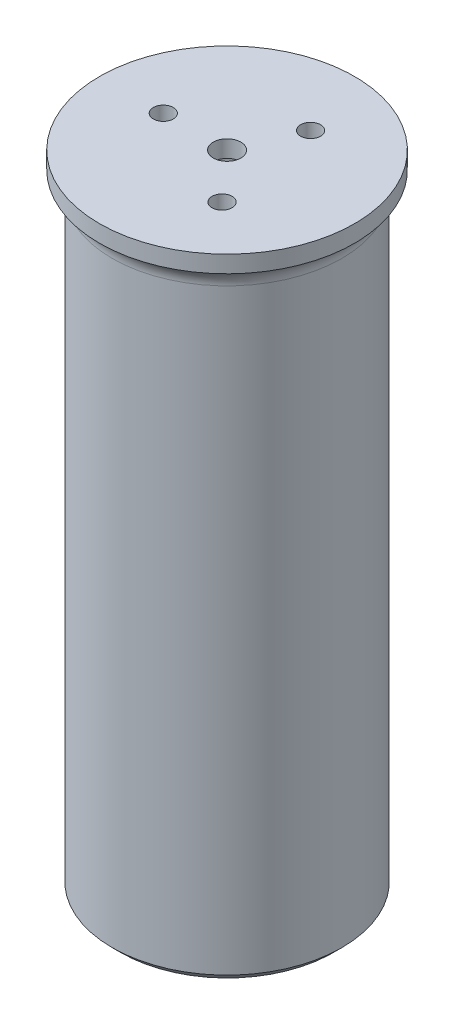
ISO-10303-21;
HEADER;
FILE_DESCRIPTION(('STEP AP214'),'2;1');
FILE_NAME('part.step','',(''),(''),'','','');
FILE_SCHEMA(('AUTOMOTIVE_DESIGN { 1 0 10303 214 1 1 1 1 }'));
ENDSEC;
DATA;
#1=APPLICATION_CONTEXT('core data for automotive mechanical design processes');
#2=APPLICATION_PROTOCOL_DEFINITION('international standard','automotive_design',2000,#1);
#3=PRODUCT_CONTEXT('',#1,'mechanical');
#4=PRODUCT('Part','Part','',(#3));
#5=PRODUCT_RELATED_PRODUCT_CATEGORY('part','',(#4));
#6=PRODUCT_DEFINITION_FORMATION('','',#4);
#7=PRODUCT_DEFINITION_CONTEXT('part definition',#1,'design');
#8=PRODUCT_DEFINITION('design','',#6,#7);
#9=PRODUCT_DEFINITION_SHAPE('','',#8);
#10=(LENGTH_UNIT() NAMED_UNIT(*) SI_UNIT(.MILLI.,.METRE.));
#11=(NAMED_UNIT(*) PLANE_ANGLE_UNIT() SI_UNIT($,.RADIAN.));
#12=(NAMED_UNIT(*) SI_UNIT($,.STERADIAN.) SOLID_ANGLE_UNIT());
#13=UNCERTAINTY_MEASURE_WITH_UNIT(LENGTH_MEASURE(1.E-05),#10,'distance_accuracy_value','');
#14=(GEOMETRIC_REPRESENTATION_CONTEXT(3) GLOBAL_UNCERTAINTY_ASSIGNED_CONTEXT((#13)) GLOBAL_UNIT_ASSIGNED_CONTEXT((#10,
#11,#12)) REPRESENTATION_CONTEXT('',''));
#15=CARTESIAN_POINT('',(0.,0.,0.));
#16=DIRECTION('',(0.,0.,1.));
#17=DIRECTION('',(1.,0.,0.));
#18=AXIS2_PLACEMENT_3D('',#15,#16,#17);
#19=CARTESIAN_POINT('',(0.,0.,0.));
#20=DIRECTION('',(0.,1.,0.));
#21=DIRECTION('',(0.,0.,1.));
#22=AXIS2_PLACEMENT_3D('',#19,#20,#21);
#23=PLANE('',#22);
#24=CARTESIAN_POINT('',(10.,0.,11.1803398874989));
#25=DIRECTION('',(0.,1.,0.));
#26=DIRECTION('',(0.,0.,1.));
#27=AXIS2_PLACEMENT_3D('',#24,#25,#26);
#28=CIRCLE('',#27,2.35);
#29=CARTESIAN_POINT('',(10.,0.,13.5303398874989));
#30=VERTEX_POINT('',#29);
#31=EDGE_CURVE('E67',#30,#30,#28,.T.);
#32=ORIENTED_EDGE('',*,*,#31,.T.);
#33=EDGE_LOOP('',(#32));
#34=FACE_BOUND('',#33,.T.);
#35=CARTESIAN_POINT('',(5.83240896842353,0.,-13.8196601125011));
#36=DIRECTION('',(0.,1.,0.));
#37=DIRECTION('',(0.,0.,1.));
#38=AXIS2_PLACEMENT_3D('',#35,#36,#37);
#39=CIRCLE('',#38,2.35);
#40=CARTESIAN_POINT('',(5.83240896842353,0.,-11.4696601125011));
#41=VERTEX_POINT('',#40);
#42=EDGE_CURVE('E61',#41,#41,#39,.T.);
#43=ORIENTED_EDGE('',*,*,#42,.T.);
#44=EDGE_LOOP('',(#43));
#45=FACE_BOUND('',#44,.T.);
#46=CARTESIAN_POINT('',(-15.,0.,0.00100327868052491));
#47=DIRECTION('',(0.,1.,0.));
#48=DIRECTION('',(0.,0.,1.));
#49=AXIS2_PLACEMENT_3D('',#46,#47,#48);
#50=CIRCLE('',#49,2.35);
#51=CARTESIAN_POINT('',(-15.,0.,2.35100327868052));
#52=VERTEX_POINT('',#51);
#53=EDGE_CURVE('E55',#52,#52,#50,.T.);
#54=ORIENTED_EDGE('',*,*,#53,.T.);
#55=EDGE_LOOP('',(#54));
#56=FACE_BOUND('',#55,.T.);
#57=CARTESIAN_POINT('',(0.,0.,0.));
#58=DIRECTION('',(0.,1.,0.));
#59=DIRECTION('',(0.,0.,1.));
#60=AXIS2_PLACEMENT_3D('',#57,#58,#59);
#61=CIRCLE('',#60,3.25);
#62=CARTESIAN_POINT('',(0.,0.,3.25));
#63=VERTEX_POINT('',#62);
#64=EDGE_CURVE('E70',#63,#63,#61,.T.);
#65=ORIENTED_EDGE('',*,*,#64,.T.);
#66=EDGE_LOOP('',(#65));
#67=FACE_BOUND('',#66,.T.);
#68=CARTESIAN_POINT('',(0.,0.,0.));
#69=DIRECTION('',(0.,-1.,0.));
#70=DIRECTION('',(0.,0.,-1.));
#71=AXIS2_PLACEMENT_3D('',#68,#69,#70);
#72=CIRCLE('',#71,25.);
#73=CARTESIAN_POINT('',(0.,0.,-25.));
#74=VERTEX_POINT('',#73);
#75=EDGE_CURVE('E76',#74,#74,#72,.T.);
#76=ORIENTED_EDGE('',*,*,#75,.T.);
#77=EDGE_LOOP('',(#76));
#78=FACE_BOUND('',#77,.T.);
#79=ADVANCED_FACE('F31',(#34,#45,#56,#67,#78),#23,.F.);
#80=CARTESIAN_POINT('',(0.,4.,0.));
#81=DIRECTION('',(0.,1.,0.));
#82=DIRECTION('',(0.,0.,1.));
#83=AXIS2_PLACEMENT_3D('',#80,#81,#82);
#84=PLANE('',#83);
#85=CARTESIAN_POINT('',(0.,4.,0.));
#86=DIRECTION('',(0.,1.,0.));
#87=DIRECTION('',(0.,0.,1.));
#88=AXIS2_PLACEMENT_3D('',#85,#86,#87);
#89=CIRCLE('',#88,3.25);
#90=CARTESIAN_POINT('',(0.,4.,3.25));
#91=VERTEX_POINT('',#90);
#92=EDGE_CURVE('E73',#91,#91,#89,.T.);
#93=ORIENTED_EDGE('',*,*,#92,.F.);
#94=EDGE_LOOP('',(#93));
#95=FACE_BOUND('',#94,.T.);
#96=CARTESIAN_POINT('',(5.83240896842353,4.,-13.8196601125011));
#97=DIRECTION('',(0.,1.,0.));
#98=DIRECTION('',(0.,0.,1.));
#99=AXIS2_PLACEMENT_3D('',#96,#97,#98);
#100=CIRCLE('',#99,2.35);
#101=CARTESIAN_POINT('',(5.83240896842353,4.,-11.4696601125011));
#102=VERTEX_POINT('',#101);
#103=EDGE_CURVE('E58',#102,#102,#100,.T.);
#104=ORIENTED_EDGE('',*,*,#103,.F.);
#105=EDGE_LOOP('',(#104));
#106=FACE_BOUND('',#105,.T.);
#107=CARTESIAN_POINT('',(0.,4.,0.));
#108=DIRECTION('',(0.,1.,0.));
#109=DIRECTION('',(0.,0.,1.));
#110=AXIS2_PLACEMENT_3D('',#107,#108,#109);
#111=CIRCLE('',#110,30.);
#112=CARTESIAN_POINT('',(0.,4.,30.));
#113=VERTEX_POINT('',#112);
#114=EDGE_CURVE('E46',#113,#113,#111,.T.);
#115=ORIENTED_EDGE('',*,*,#114,.T.);
#116=EDGE_LOOP('',(#115));
#117=FACE_BOUND('',#116,.T.);
#118=CARTESIAN_POINT('',(-15.,4.,0.00100327868052491));
#119=DIRECTION('',(0.,1.,0.));
#120=DIRECTION('',(0.,0.,1.));
#121=AXIS2_PLACEMENT_3D('',#118,#119,#120);
#122=CIRCLE('',#121,2.35);
#123=CARTESIAN_POINT('',(-15.,4.,2.35100327868052));
#124=VERTEX_POINT('',#123);
#125=EDGE_CURVE('E52',#124,#124,#122,.T.);
#126=ORIENTED_EDGE('',*,*,#125,.F.);
#127=EDGE_LOOP('',(#126));
#128=FACE_BOUND('',#127,.T.);
#129=CARTESIAN_POINT('',(10.,4.,11.1803398874989));
#130=DIRECTION('',(0.,1.,0.));
#131=DIRECTION('',(0.,0.,1.));
#132=AXIS2_PLACEMENT_3D('',#129,#130,#131);
#133=CIRCLE('',#132,2.35);
#134=CARTESIAN_POINT('',(10.,4.,13.5303398874989));
#135=VERTEX_POINT('',#134);
#136=EDGE_CURVE('E64',#135,#135,#133,.T.);
#137=ORIENTED_EDGE('',*,*,#136,.F.);
#138=EDGE_LOOP('',(#137));
#139=FACE_BOUND('',#138,.T.);
#140=ADVANCED_FACE('F97',(#95,#106,#117,#128,#139),#84,.T.);
#141=CARTESIAN_POINT('',(0.,4.,0.));
#142=DIRECTION('',(0.,-1.,0.));
#143=DIRECTION('',(0.,0.,-1.));
#144=AXIS2_PLACEMENT_3D('',#141,#142,#143);
#145=CYLINDRICAL_SURFACE('',#144,30.);
#146=ORIENTED_EDGE('',*,*,#114,.F.);
#147=EDGE_LOOP('',(#146));
#148=FACE_BOUND('',#147,.T.);
#149=CARTESIAN_POINT('',(0.,0.,0.));
#150=DIRECTION('',(0.,1.,0.));
#151=DIRECTION('',(0.,0.,1.));
#152=AXIS2_PLACEMENT_3D('',#149,#150,#151);
#153=CIRCLE('',#152,30.);
#154=CARTESIAN_POINT('',(0.,0.,30.));
#155=VERTEX_POINT('',#154);
#156=EDGE_CURVE('E49',#155,#155,#153,.T.);
#157=ORIENTED_EDGE('',*,*,#156,.T.);
#158=EDGE_LOOP('',(#157));
#159=FACE_BOUND('',#158,.T.);
#160=ADVANCED_FACE('F103',(#148,#159),#145,.T.);
#161=CARTESIAN_POINT('',(-15.,4.,0.00100327868052491));
#162=DIRECTION('',(0.,-1.,0.));
#163=DIRECTION('',(0.,0.,-1.));
#164=AXIS2_PLACEMENT_3D('',#161,#162,#163);
#165=CYLINDRICAL_SURFACE('',#164,2.35);
#166=ORIENTED_EDGE('',*,*,#125,.T.);
#167=EDGE_LOOP('',(#166));
#168=FACE_BOUND('',#167,.T.);
#169=ORIENTED_EDGE('',*,*,#53,.F.);
#170=EDGE_LOOP('',(#169));
#171=FACE_BOUND('',#170,.T.);
#172=ADVANCED_FACE('F110',(#168,#171),#165,.F.);
#173=CARTESIAN_POINT('',(5.83240896842353,4.,-13.8196601125011));
#174=DIRECTION('',(0.,-1.,0.));
#175=DIRECTION('',(0.,0.,-1.));
#176=AXIS2_PLACEMENT_3D('',#173,#174,#175);
#177=CYLINDRICAL_SURFACE('',#176,2.35);
#178=ORIENTED_EDGE('',*,*,#103,.T.);
#179=EDGE_LOOP('',(#178));
#180=FACE_BOUND('',#179,.T.);
#181=ORIENTED_EDGE('',*,*,#42,.F.);
#182=EDGE_LOOP('',(#181));
#183=FACE_BOUND('',#182,.T.);
#184=ADVANCED_FACE('F115',(#180,#183),#177,.F.);
#185=CARTESIAN_POINT('',(10.,4.,11.1803398874989));
#186=DIRECTION('',(0.,-1.,0.));
#187=DIRECTION('',(0.,0.,-1.));
#188=AXIS2_PLACEMENT_3D('',#185,#186,#187);
#189=CYLINDRICAL_SURFACE('',#188,2.35);
#190=ORIENTED_EDGE('',*,*,#136,.T.);
#191=EDGE_LOOP('',(#190));
#192=FACE_BOUND('',#191,.T.);
#193=ORIENTED_EDGE('',*,*,#31,.F.);
#194=EDGE_LOOP('',(#193));
#195=FACE_BOUND('',#194,.T.);
#196=ADVANCED_FACE('F146',(#192,#195),#189,.F.);
#197=CARTESIAN_POINT('',(0.,0.,0.));
#198=DIRECTION('',(0.,1.,0.));
#199=DIRECTION('',(0.,0.,1.));
#200=AXIS2_PLACEMENT_3D('',#197,#198,#199);
#201=CYLINDRICAL_SURFACE('',#200,3.25);
#202=ORIENTED_EDGE('',*,*,#64,.F.);
#203=EDGE_LOOP('',(#202));
#204=FACE_BOUND('',#203,.T.);
#205=ORIENTED_EDGE('',*,*,#92,.T.);
#206=EDGE_LOOP('',(#205));
#207=FACE_BOUND('',#206,.T.);
#208=ADVANCED_FACE('F94',(#204,#207),#201,.F.);
#209=CARTESIAN_POINT('',(0.,-150.,0.));
#210=DIRECTION('',(0.,1.,0.));
#211=DIRECTION('',(0.,0.,1.));
#212=AXIS2_PLACEMENT_3D('',#209,#210,#211);
#213=CYLINDRICAL_SURFACE('',#212,27.);
#214=CARTESIAN_POINT('',(0.,-4.58257569495585,0.));
#215=DIRECTION('',(0.,1.,0.));
#216=DIRECTION('',(0.,0.,1.));
#217=AXIS2_PLACEMENT_3D('',#214,#215,#216);
#218=CIRCLE('',#217,27.);
#219=CARTESIAN_POINT('',(0.,-4.58257569495585,27.));
#220=VERTEX_POINT('',#219);
#221=EDGE_CURVE('E10',#220,#220,#218,.F.);
#222=ORIENTED_EDGE('',*,*,#221,.T.);
#223=EDGE_LOOP('',(#222));
#224=FACE_BOUND('',#223,.T.);
#225=CARTESIAN_POINT('',(0.,-145.,0.));
#226=DIRECTION('',(0.,-1.,0.));
#227=DIRECTION('',(0.,0.,-1.));
#228=AXIS2_PLACEMENT_3D('',#225,#226,#227);
#229=CIRCLE('',#228,27.);
#230=CARTESIAN_POINT('',(0.,-145.,-27.));
#231=VERTEX_POINT('',#230);
#232=EDGE_CURVE('E38',#231,#231,#229,.F.);
#233=ORIENTED_EDGE('',*,*,#232,.T.);
#234=EDGE_LOOP('',(#233));
#235=FACE_BOUND('',#234,.T.);
#236=ADVANCED_FACE('F86',(#224,#235),#213,.T.);
#237=CARTESIAN_POINT('',(0.,-150.,0.));
#238=DIRECTION('',(0.,1.,0.));
#239=DIRECTION('',(0.,0.,1.));
#240=AXIS2_PLACEMENT_3D('',#237,#238,#239);
#241=CYLINDRICAL_SURFACE('',#240,25.);
#242=CARTESIAN_POINT('',(0.,-147.,0.));
#243=DIRECTION('',(0.,1.,0.));
#244=DIRECTION('',(0.,0.,1.));
#245=AXIS2_PLACEMENT_3D('',#242,#243,#244);
#246=CIRCLE('',#245,25.);
#247=CARTESIAN_POINT('',(0.,-147.,25.));
#248=VERTEX_POINT('',#247);
#249=EDGE_CURVE('E42',#248,#248,#246,.F.);
#250=ORIENTED_EDGE('',*,*,#249,.T.);
#251=EDGE_LOOP('',(#250));
#252=FACE_BOUND('',#251,.T.);
#253=ORIENTED_EDGE('',*,*,#75,.F.);
#254=EDGE_LOOP('',(#253));
#255=FACE_BOUND('',#254,.T.);
#256=ADVANCED_FACE('F83',(#252,#255),#241,.F.);
#257=CARTESIAN_POINT('',(0.,-150.,0.));
#258=DIRECTION('',(0.,1.,0.));
#259=DIRECTION('',(0.,0.,1.));
#260=AXIS2_PLACEMENT_3D('',#257,#258,#259);
#261=CONICAL_SURFACE('',#260,21.9999999999999,0.785398163397454);
#262=ORIENTED_EDGE('',*,*,#232,.F.);
#263=EDGE_LOOP('',(#262));
#264=FACE_BOUND('',#263,.T.);
#265=ORIENTED_EDGE('',*,*,#249,.F.);
#266=EDGE_LOOP('',(#265));
#267=FACE_BOUND('',#266,.T.);
#268=ADVANCED_FACE('F85',(#264,#267),#261,.T.);
#269=CARTESIAN_POINT('',(0.,-4.58257569495584,0.));
#270=DIRECTION('',(0.,1.,0.));
#271=DIRECTION('',(0.,0.,1.));
#272=AXIS2_PLACEMENT_3D('',#269,#270,#271);
#273=TOROIDAL_SURFACE('',#272,32.,5.);
#274=ORIENTED_EDGE('',*,*,#156,.F.);
#275=EDGE_LOOP('',(#274));
#276=FACE_BOUND('',#275,.T.);
#277=ORIENTED_EDGE('',*,*,#221,.F.);
#278=EDGE_LOOP('',(#277));
#279=FACE_BOUND('',#278,.T.);
#280=ADVANCED_FACE('F33',(#276,#279),#273,.F.);
#281=CLOSED_SHELL('',(#79,#140,#160,#172,#184,#196,#208,#236,#256,#268,#280));
#282=MANIFOLD_SOLID_BREP('B2',#281);
#283=ADVANCED_BREP_SHAPE_REPRESENTATION('',(#18,#282),#14);
#284=SHAPE_DEFINITION_REPRESENTATION(#9,#283);
ENDSEC;
END-ISO-10303-21;
